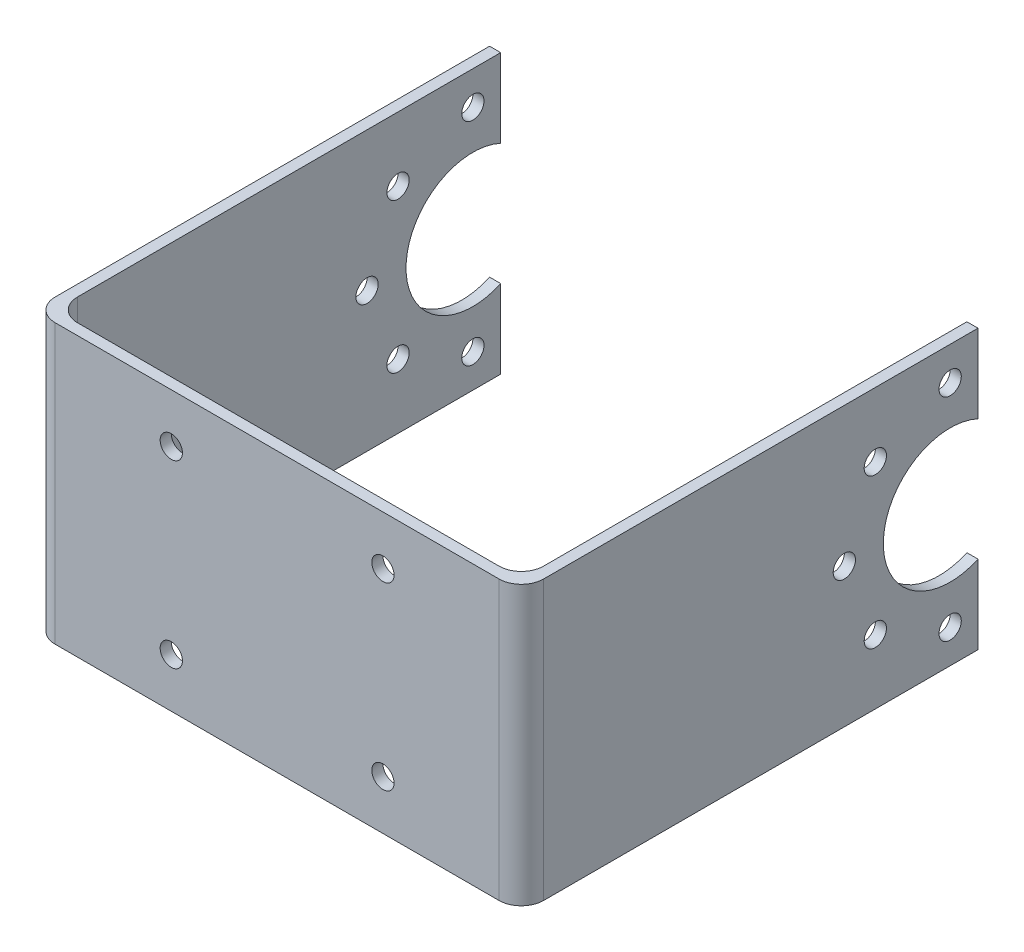
ISO-10303-21;
HEADER;
FILE_DESCRIPTION(('STEP AP214'),'2;1');
FILE_NAME('part.step','',(''),(''),'','','');
FILE_SCHEMA(('AUTOMOTIVE_DESIGN { 1 0 10303 214 1 1 1 1 }'));
ENDSEC;
DATA;
#1=APPLICATION_CONTEXT('core data for automotive mechanical design processes');
#2=APPLICATION_PROTOCOL_DEFINITION('international standard','automotive_design',2000,#1);
#3=PRODUCT_CONTEXT('',#1,'mechanical');
#4=PRODUCT('Part','Part','',(#3));
#5=PRODUCT_RELATED_PRODUCT_CATEGORY('part','',(#4));
#6=PRODUCT_DEFINITION_FORMATION('','',#4);
#7=PRODUCT_DEFINITION_CONTEXT('part definition',#1,'design');
#8=PRODUCT_DEFINITION('design','',#6,#7);
#9=PRODUCT_DEFINITION_SHAPE('','',#8);
#10=(LENGTH_UNIT() NAMED_UNIT(*) SI_UNIT(.MILLI.,.METRE.));
#11=(NAMED_UNIT(*) PLANE_ANGLE_UNIT() SI_UNIT($,.RADIAN.));
#12=(NAMED_UNIT(*) SI_UNIT($,.STERADIAN.) SOLID_ANGLE_UNIT());
#13=UNCERTAINTY_MEASURE_WITH_UNIT(LENGTH_MEASURE(1.E-05),#10,'distance_accuracy_value','');
#14=(GEOMETRIC_REPRESENTATION_CONTEXT(3) GLOBAL_UNCERTAINTY_ASSIGNED_CONTEXT((#13)) GLOBAL_UNIT_ASSIGNED_CONTEXT((#10,
#11,#12)) REPRESENTATION_CONTEXT('',''));
#15=CARTESIAN_POINT('',(0.,0.,0.));
#16=DIRECTION('',(0.,0.,1.));
#17=DIRECTION('',(1.,0.,0.));
#18=AXIS2_PLACEMENT_3D('',#15,#16,#17);
#19=CARTESIAN_POINT('',(21.3500000000001,25.,-40.5));
#20=DIRECTION('',(0.,0.,1.));
#21=DIRECTION('',(1.,0.,0.));
#22=AXIS2_PLACEMENT_3D('',#19,#20,#21);
#23=PLANE('',#22);
#24=DIRECTION('',(0.,-1.,0.));
#25=VECTOR('',#24,1.);
#26=CARTESIAN_POINT('',(20.3500000000001,25.,-40.5));
#27=LINE('',#26,#25);
#28=CARTESIAN_POINT('',(20.3500000000001,7.04564394268216,-40.5));
#29=VERTEX_POINT('',#28);
#30=CARTESIAN_POINT('',(20.3500000000001,0.,-40.5));
#31=VERTEX_POINT('',#30);
#32=EDGE_CURVE('E216',#29,#31,#27,.T.);
#33=ORIENTED_EDGE('',*,*,#32,.F.);
#34=DIRECTION('',(1.,0.,0.));
#35=VECTOR('',#34,1.);
#36=CARTESIAN_POINT('',(-22.4999999999999,7.04564394268215,-40.5));
#37=LINE('',#36,#35);
#38=CARTESIAN_POINT('',(21.3500000000001,7.04564394268215,-40.5));
#39=VERTEX_POINT('',#38);
#40=EDGE_CURVE('E200',#29,#39,#37,.T.);
#41=ORIENTED_EDGE('',*,*,#40,.T.);
#42=DIRECTION('',(0.,-1.,0.));
#43=VECTOR('',#42,1.);
#44=CARTESIAN_POINT('',(21.3500000000001,25.,-40.5));
#45=LINE('',#44,#43);
#46=CARTESIAN_POINT('',(21.3500000000001,0.,-40.5));
#47=VERTEX_POINT('',#46);
#48=EDGE_CURVE('E220',#39,#47,#45,.T.);
#49=ORIENTED_EDGE('',*,*,#48,.T.);
#50=DIRECTION('',(-1.,0.,0.));
#51=VECTOR('',#50,1.);
#52=CARTESIAN_POINT('',(21.3500000000001,0.,-40.5));
#53=LINE('',#52,#51);
#54=EDGE_CURVE('E272',#47,#31,#53,.T.);
#55=ORIENTED_EDGE('',*,*,#54,.T.);
#56=EDGE_LOOP('',(#33,#41,#49,#55));
#57=FACE_BOUND('',#56,.T.);
#58=ADVANCED_FACE('F65',(#57),#23,.F.);
#59=CARTESIAN_POINT('',(-22.4999999999999,25.,-40.5));
#60=DIRECTION('',(0.,0.,1.));
#61=DIRECTION('',(1.,0.,0.));
#62=AXIS2_PLACEMENT_3D('',#59,#60,#61);
#63=PLANE('',#62);
#64=DIRECTION('',(0.,-1.,0.));
#65=VECTOR('',#64,1.);
#66=CARTESIAN_POINT('',(-22.4999999999999,25.,-40.5));
#67=LINE('',#66,#65);
#68=CARTESIAN_POINT('',(-22.4999999999999,7.04564394268215,-40.5));
#69=VERTEX_POINT('',#68);
#70=CARTESIAN_POINT('',(-22.4999999999999,0.,-40.5));
#71=VERTEX_POINT('',#70);
#72=EDGE_CURVE('E207',#69,#71,#67,.T.);
#73=ORIENTED_EDGE('',*,*,#72,.F.);
#74=CARTESIAN_POINT('',(-21.4999999999999,7.04564394268215,-40.5));
#75=VERTEX_POINT('',#74);
#76=EDGE_CURVE('E184',#69,#75,#37,.T.);
#77=ORIENTED_EDGE('',*,*,#76,.T.);
#78=DIRECTION('',(0.,-1.,0.));
#79=VECTOR('',#78,1.);
#80=CARTESIAN_POINT('',(-21.4999999999999,25.,-40.5));
#81=LINE('',#80,#79);
#82=CARTESIAN_POINT('',(-21.4999999999999,0.,-40.5));
#83=VERTEX_POINT('',#82);
#84=EDGE_CURVE('E206',#75,#83,#81,.T.);
#85=ORIENTED_EDGE('',*,*,#84,.T.);
#86=DIRECTION('',(-1.,0.,0.));
#87=VECTOR('',#86,1.);
#88=CARTESIAN_POINT('',(-22.4999999999999,0.,-40.5));
#89=LINE('',#88,#87);
#90=EDGE_CURVE('E298',#83,#71,#89,.T.);
#91=ORIENTED_EDGE('',*,*,#90,.T.);
#92=EDGE_LOOP('',(#73,#77,#85,#91));
#93=FACE_BOUND('',#92,.T.);
#94=ADVANCED_FACE('F450',(#93),#63,.F.);
#95=CARTESIAN_POINT('',(21.3500000000001,25.,-0.500000000000001));
#96=DIRECTION('',(-1.,0.,0.));
#97=DIRECTION('',(0.,0.,1.));
#98=AXIS2_PLACEMENT_3D('',#95,#96,#97);
#99=PLANE('',#98);
#100=CARTESIAN_POINT('',(21.3500000000001,5.7824855787278,-31.2824855787278));
#101=DIRECTION('',(1.,0.,0.));
#102=DIRECTION('',(0.,0.,-1.));
#103=AXIS2_PLACEMENT_3D('',#100,#101,#102);
#104=CIRCLE('',#103,0.999999999999998);
#105=CARTESIAN_POINT('',(21.3500000000001,5.7824855787278,-32.2824855787278));
#106=VERTEX_POINT('',#105);
#107=EDGE_CURVE('E370',#106,#106,#104,.T.);
#108=ORIENTED_EDGE('',*,*,#107,.F.);
#109=EDGE_LOOP('',(#108));
#110=FACE_BOUND('',#109,.T.);
#111=CARTESIAN_POINT('',(21.3500000000001,3.,-38.));
#112=DIRECTION('',(1.,0.,0.));
#113=DIRECTION('',(0.,0.,-1.));
#114=AXIS2_PLACEMENT_3D('',#111,#112,#113);
#115=CIRCLE('',#114,0.999999999999998);
#116=CARTESIAN_POINT('',(21.3500000000001,3.,-39.));
#117=VERTEX_POINT('',#116);
#118=EDGE_CURVE('E358',#117,#117,#115,.T.);
#119=ORIENTED_EDGE('',*,*,#118,.F.);
#120=EDGE_LOOP('',(#119));
#121=FACE_BOUND('',#120,.T.);
#122=CARTESIAN_POINT('',(21.3500000000001,12.5,-28.5));
#123=DIRECTION('',(1.,0.,0.));
#124=DIRECTION('',(0.,0.,-1.));
#125=AXIS2_PLACEMENT_3D('',#122,#123,#124);
#126=CIRCLE('',#125,1.);
#127=CARTESIAN_POINT('',(21.3500000000001,12.5,-29.5));
#128=VERTEX_POINT('',#127);
#129=EDGE_CURVE('E346',#128,#128,#126,.T.);
#130=ORIENTED_EDGE('',*,*,#129,.F.);
#131=EDGE_LOOP('',(#130));
#132=FACE_BOUND('',#131,.T.);
#133=CARTESIAN_POINT('',(21.3500000000001,19.2175144212722,-31.2824855787278));
#134=DIRECTION('',(1.,0.,0.));
#135=DIRECTION('',(0.,0.,-1.));
#136=AXIS2_PLACEMENT_3D('',#133,#134,#135);
#137=CIRCLE('',#136,1.00000000000001);
#138=CARTESIAN_POINT('',(21.3500000000001,19.2175144212722,-32.2824855787278));
#139=VERTEX_POINT('',#138);
#140=EDGE_CURVE('E334',#139,#139,#137,.T.);
#141=ORIENTED_EDGE('',*,*,#140,.F.);
#142=EDGE_LOOP('',(#141));
#143=FACE_BOUND('',#142,.T.);
#144=CARTESIAN_POINT('',(21.3500000000001,22.,-38.));
#145=DIRECTION('',(1.,0.,0.));
#146=DIRECTION('',(0.,0.,-1.));
#147=AXIS2_PLACEMENT_3D('',#144,#145,#146);
#148=CIRCLE('',#147,0.999999999999998);
#149=CARTESIAN_POINT('',(21.3500000000001,22.,-39.));
#150=VERTEX_POINT('',#149);
#151=EDGE_CURVE('E322',#150,#150,#148,.T.);
#152=ORIENTED_EDGE('',*,*,#151,.F.);
#153=EDGE_LOOP('',(#152));
#154=FACE_BOUND('',#153,.T.);
#155=DIRECTION('',(0.,0.,-1.));
#156=VECTOR('',#155,1.);
#157=CARTESIAN_POINT('',(21.3500000000001,25.,-0.500000000000001));
#158=LINE('',#157,#156);
#159=CARTESIAN_POINT('',(21.3500000000001,25.,-1.5));
#160=VERTEX_POINT('',#159);
#161=CARTESIAN_POINT('',(21.3500000000001,25.,-40.5));
#162=VERTEX_POINT('',#161);
#163=EDGE_CURVE('E304',#160,#162,#158,.T.);
#164=ORIENTED_EDGE('',*,*,#163,.F.);
#165=DIRECTION('',(0.,-1.,0.));
#166=VECTOR('',#165,1.);
#167=CARTESIAN_POINT('',(21.3500000000001,25.,-1.5));
#168=LINE('',#167,#166);
#169=CARTESIAN_POINT('',(21.3500000000001,0.,-1.5));
#170=VERTEX_POINT('',#169);
#171=EDGE_CURVE('E246',#160,#170,#168,.T.);
#172=ORIENTED_EDGE('',*,*,#171,.T.);
#173=DIRECTION('',(0.,0.,-1.));
#174=VECTOR('',#173,1.);
#175=CARTESIAN_POINT('',(21.3500000000001,0.,-0.500000000000001));
#176=LINE('',#175,#174);
#177=EDGE_CURVE('E291',#170,#47,#176,.T.);
#178=ORIENTED_EDGE('',*,*,#177,.T.);
#179=ORIENTED_EDGE('',*,*,#48,.F.);
#180=CARTESIAN_POINT('',(21.3500000000001,12.5,-38.));
#181=DIRECTION('',(1.,0.,0.));
#182=DIRECTION('',(0.,0.,-1.));
#183=AXIS2_PLACEMENT_3D('',#180,#181,#182);
#184=CIRCLE('',#183,5.99999999999999);
#185=CARTESIAN_POINT('',(21.3500000000001,17.9543560573178,-40.5));
#186=VERTEX_POINT('',#185);
#187=EDGE_CURVE('E189',#186,#39,#184,.T.);
#188=ORIENTED_EDGE('',*,*,#187,.F.);
#189=EDGE_CURVE('E221',#162,#186,#45,.T.);
#190=ORIENTED_EDGE('',*,*,#189,.F.);
#191=EDGE_LOOP('',(#164,#172,#178,#179,#188,#190));
#192=FACE_BOUND('',#191,.T.);
#193=ADVANCED_FACE('F425',(#110,#121,#132,#143,#154,#192),#99,.F.);
#194=ORIENTED_EDGE('',*,*,#189,.T.);
#195=DIRECTION('',(1.,0.,0.));
#196=VECTOR('',#195,1.);
#197=CARTESIAN_POINT('',(-22.4999999999999,17.9543560573178,-40.5));
#198=LINE('',#197,#196);
#199=CARTESIAN_POINT('',(20.3500000000001,17.9543560573178,-40.5));
#200=VERTEX_POINT('',#199);
#201=EDGE_CURVE('E188',#200,#186,#198,.T.);
#202=ORIENTED_EDGE('',*,*,#201,.F.);
#203=CARTESIAN_POINT('',(20.3500000000001,25.,-40.5));
#204=VERTEX_POINT('',#203);
#205=EDGE_CURVE('E217',#204,#200,#27,.T.);
#206=ORIENTED_EDGE('',*,*,#205,.F.);
#207=DIRECTION('',(-1.,0.,0.));
#208=VECTOR('',#207,1.);
#209=CARTESIAN_POINT('',(21.3500000000001,25.,-40.5));
#210=LINE('',#209,#208);
#211=EDGE_CURVE('E283',#162,#204,#210,.T.);
#212=ORIENTED_EDGE('',*,*,#211,.F.);
#213=EDGE_LOOP('',(#194,#202,#206,#212));
#214=FACE_BOUND('',#213,.T.);
#215=ADVANCED_FACE('F433',(#214),#23,.F.);
#216=CARTESIAN_POINT('',(20.3500000000001,25.,-0.499999999999996));
#217=DIRECTION('',(1.,0.,0.));
#218=DIRECTION('',(0.,0.,-1.));
#219=AXIS2_PLACEMENT_3D('',#216,#217,#218);
#220=PLANE('',#219);
#221=CARTESIAN_POINT('',(20.3500000000001,5.7824855787278,-31.2824855787278));
#222=DIRECTION('',(1.,0.,0.));
#223=DIRECTION('',(0.,0.,-1.));
#224=AXIS2_PLACEMENT_3D('',#221,#222,#223);
#225=CIRCLE('',#224,0.999999999999998);
#226=CARTESIAN_POINT('',(20.3500000000001,5.7824855787278,-32.2824855787278));
#227=VERTEX_POINT('',#226);
#228=EDGE_CURVE('E362',#227,#227,#225,.T.);
#229=ORIENTED_EDGE('',*,*,#228,.T.);
#230=EDGE_LOOP('',(#229));
#231=FACE_BOUND('',#230,.T.);
#232=CARTESIAN_POINT('',(20.3500000000001,3.,-38.));
#233=DIRECTION('',(1.,0.,0.));
#234=DIRECTION('',(0.,0.,-1.));
#235=AXIS2_PLACEMENT_3D('',#232,#233,#234);
#236=CIRCLE('',#235,0.999999999999998);
#237=CARTESIAN_POINT('',(20.3500000000001,3.,-39.));
#238=VERTEX_POINT('',#237);
#239=EDGE_CURVE('E350',#238,#238,#236,.T.);
#240=ORIENTED_EDGE('',*,*,#239,.T.);
#241=EDGE_LOOP('',(#240));
#242=FACE_BOUND('',#241,.T.);
#243=CARTESIAN_POINT('',(20.3500000000001,12.5,-28.5));
#244=DIRECTION('',(1.,0.,0.));
#245=DIRECTION('',(0.,0.,-1.));
#246=AXIS2_PLACEMENT_3D('',#243,#244,#245);
#247=CIRCLE('',#246,1.);
#248=CARTESIAN_POINT('',(20.3500000000001,12.5,-29.5));
#249=VERTEX_POINT('',#248);
#250=EDGE_CURVE('E338',#249,#249,#247,.T.);
#251=ORIENTED_EDGE('',*,*,#250,.T.);
#252=EDGE_LOOP('',(#251));
#253=FACE_BOUND('',#252,.T.);
#254=CARTESIAN_POINT('',(20.3500000000001,19.2175144212722,-31.2824855787278));
#255=DIRECTION('',(1.,0.,0.));
#256=DIRECTION('',(0.,0.,-1.));
#257=AXIS2_PLACEMENT_3D('',#254,#255,#256);
#258=CIRCLE('',#257,1.00000000000001);
#259=CARTESIAN_POINT('',(20.3500000000001,19.2175144212722,-32.2824855787278));
#260=VERTEX_POINT('',#259);
#261=EDGE_CURVE('E326',#260,#260,#258,.T.);
#262=ORIENTED_EDGE('',*,*,#261,.T.);
#263=EDGE_LOOP('',(#262));
#264=FACE_BOUND('',#263,.T.);
#265=CARTESIAN_POINT('',(20.3500000000001,22.,-38.));
#266=DIRECTION('',(1.,0.,0.));
#267=DIRECTION('',(0.,0.,-1.));
#268=AXIS2_PLACEMENT_3D('',#265,#266,#267);
#269=CIRCLE('',#268,0.999999999999998);
#270=CARTESIAN_POINT('',(20.3500000000001,22.,-39.));
#271=VERTEX_POINT('',#270);
#272=EDGE_CURVE('E315',#271,#271,#269,.T.);
#273=ORIENTED_EDGE('',*,*,#272,.T.);
#274=EDGE_LOOP('',(#273));
#275=FACE_BOUND('',#274,.T.);
#276=DIRECTION('',(0.,0.,1.));
#277=VECTOR('',#276,1.);
#278=CARTESIAN_POINT('',(20.3500000000001,0.,-0.499999999999996));
#279=LINE('',#278,#277);
#280=CARTESIAN_POINT('',(20.3500000000001,0.,-2.5));
#281=VERTEX_POINT('',#280);
#282=EDGE_CURVE('E260',#31,#281,#279,.T.);
#283=ORIENTED_EDGE('',*,*,#282,.T.);
#284=DIRECTION('',(0.,-1.,0.));
#285=VECTOR('',#284,1.);
#286=CARTESIAN_POINT('',(20.3500000000001,25.,-2.5));
#287=LINE('',#286,#285);
#288=CARTESIAN_POINT('',(20.3500000000001,25.,-2.5));
#289=VERTEX_POINT('',#288);
#290=EDGE_CURVE('E249',#281,#289,#287,.F.);
#291=ORIENTED_EDGE('',*,*,#290,.T.);
#292=DIRECTION('',(0.,0.,1.));
#293=VECTOR('',#292,1.);
#294=CARTESIAN_POINT('',(20.3500000000001,25.,-0.499999999999996));
#295=LINE('',#294,#293);
#296=EDGE_CURVE('E277',#204,#289,#295,.T.);
#297=ORIENTED_EDGE('',*,*,#296,.F.);
#298=ORIENTED_EDGE('',*,*,#205,.T.);
#299=CARTESIAN_POINT('',(20.3500000000001,12.5,-38.));
#300=DIRECTION('',(1.,0.,0.));
#301=DIRECTION('',(0.,0.,-1.));
#302=AXIS2_PLACEMENT_3D('',#299,#300,#301);
#303=CIRCLE('',#302,5.99999999999999);
#304=EDGE_CURVE('E293',#200,#29,#303,.T.);
#305=ORIENTED_EDGE('',*,*,#304,.T.);
#306=ORIENTED_EDGE('',*,*,#32,.T.);
#307=EDGE_LOOP('',(#283,#291,#297,#298,#305,#306));
#308=FACE_BOUND('',#307,.T.);
#309=ADVANCED_FACE('F266',(#231,#242,#253,#264,#275,#308),#220,.F.);
#310=CARTESIAN_POINT('',(-21.4999999999999,25.,-0.499999999999996));
#311=DIRECTION('',(0.,0.,1.));
#312=DIRECTION('',(1.,0.,0.));
#313=AXIS2_PLACEMENT_3D('',#310,#311,#312);
#314=PLANE('',#313);
#315=CARTESIAN_POINT('',(8.92500000000006,4.415,-0.499999999999994));
#316=DIRECTION('',(0.,0.,1.));
#317=DIRECTION('',(1.,0.,0.));
#318=AXIS2_PLACEMENT_3D('',#315,#316,#317);
#319=CIRCLE('',#318,1.);
#320=CARTESIAN_POINT('',(9.92500000000006,4.415,-0.499999999999994));
#321=VERTEX_POINT('',#320);
#322=EDGE_CURVE('E394',#321,#321,#319,.T.);
#323=ORIENTED_EDGE('',*,*,#322,.T.);
#324=EDGE_LOOP('',(#323));
#325=FACE_BOUND('',#324,.T.);
#326=CARTESIAN_POINT('',(8.92500000000006,20.585,-0.499999999999994));
#327=DIRECTION('',(0.,0.,1.));
#328=DIRECTION('',(1.,0.,0.));
#329=AXIS2_PLACEMENT_3D('',#326,#327,#328);
#330=CIRCLE('',#329,1.);
#331=CARTESIAN_POINT('',(9.92500000000006,20.585,-0.499999999999994));
#332=VERTEX_POINT('',#331);
#333=EDGE_CURVE('E388',#332,#332,#330,.T.);
#334=ORIENTED_EDGE('',*,*,#333,.T.);
#335=EDGE_LOOP('',(#334));
#336=FACE_BOUND('',#335,.T.);
#337=CARTESIAN_POINT('',(-10.0749999999999,4.415,-0.499999999999994));
#338=DIRECTION('',(0.,0.,1.));
#339=DIRECTION('',(1.,0.,0.));
#340=AXIS2_PLACEMENT_3D('',#337,#338,#339);
#341=CIRCLE('',#340,1.);
#342=CARTESIAN_POINT('',(-9.07499999999994,4.415,-0.499999999999994));
#343=VERTEX_POINT('',#342);
#344=EDGE_CURVE('E382',#343,#343,#341,.T.);
#345=ORIENTED_EDGE('',*,*,#344,.T.);
#346=EDGE_LOOP('',(#345));
#347=FACE_BOUND('',#346,.T.);
#348=CARTESIAN_POINT('',(-10.0749999999999,20.585,-0.499999999999994));
#349=DIRECTION('',(0.,0.,1.));
#350=DIRECTION('',(1.,0.,0.));
#351=AXIS2_PLACEMENT_3D('',#348,#349,#350);
#352=CIRCLE('',#351,1.);
#353=CARTESIAN_POINT('',(-9.07499999999994,20.585,-0.499999999999994));
#354=VERTEX_POINT('',#353);
#355=EDGE_CURVE('E374',#354,#354,#352,.T.);
#356=ORIENTED_EDGE('',*,*,#355,.T.);
#357=EDGE_LOOP('',(#356));
#358=FACE_BOUND('',#357,.T.);
#359=DIRECTION('',(-1.,0.,0.));
#360=VECTOR('',#359,1.);
#361=CARTESIAN_POINT('',(-21.4999999999999,0.,-0.499999999999996));
#362=LINE('',#361,#360);
#363=CARTESIAN_POINT('',(18.35,0.,-0.499999999999996));
#364=VERTEX_POINT('',#363);
#365=CARTESIAN_POINT('',(-19.4999999999999,0.,-0.499999999999996));
#366=VERTEX_POINT('',#365);
#367=EDGE_CURVE('E261',#364,#366,#362,.T.);
#368=ORIENTED_EDGE('',*,*,#367,.T.);
#369=DIRECTION('',(0.,-1.,0.));
#370=VECTOR('',#369,1.);
#371=CARTESIAN_POINT('',(-19.4999999999999,25.,-0.499999999999996));
#372=LINE('',#371,#370);
#373=CARTESIAN_POINT('',(-19.4999999999999,25.,-0.499999999999996));
#374=VERTEX_POINT('',#373);
#375=EDGE_CURVE('E88',#366,#374,#372,.F.);
#376=ORIENTED_EDGE('',*,*,#375,.T.);
#377=DIRECTION('',(-1.,0.,0.));
#378=VECTOR('',#377,1.);
#379=CARTESIAN_POINT('',(-21.4999999999999,25.,-0.499999999999996));
#380=LINE('',#379,#378);
#381=CARTESIAN_POINT('',(18.35,25.,-0.499999999999996));
#382=VERTEX_POINT('',#381);
#383=EDGE_CURVE('E276',#382,#374,#380,.T.);
#384=ORIENTED_EDGE('',*,*,#383,.F.);
#385=DIRECTION('',(0.,-1.,0.));
#386=VECTOR('',#385,1.);
#387=CARTESIAN_POINT('',(18.3500000000001,0.,-0.499999999999996));
#388=LINE('',#387,#386);
#389=EDGE_CURVE('E242',#382,#364,#388,.T.);
#390=ORIENTED_EDGE('',*,*,#389,.T.);
#391=EDGE_LOOP('',(#368,#376,#384,#390));
#392=FACE_BOUND('',#391,.T.);
#393=ADVANCED_FACE('F278',(#325,#336,#347,#358,#392),#314,.F.);
#394=CARTESIAN_POINT('',(-21.4999999999999,25.,-0.499999999999996));
#395=DIRECTION('',(-1.,0.,0.));
#396=DIRECTION('',(0.,0.,1.));
#397=AXIS2_PLACEMENT_3D('',#394,#395,#396);
#398=PLANE('',#397);
#399=CARTESIAN_POINT('',(-21.4999999999999,5.7824855787278,-31.2824855787278));
#400=DIRECTION('',(-1.,0.,0.));
#401=DIRECTION('',(0.,0.,1.));
#402=AXIS2_PLACEMENT_3D('',#399,#400,#401);
#403=CIRCLE('',#402,0.999999999999998);
#404=CARTESIAN_POINT('',(-21.4999999999999,5.7824855787278,-30.2824855787278));
#405=VERTEX_POINT('',#404);
#406=EDGE_CURVE('E367',#405,#405,#403,.T.);
#407=ORIENTED_EDGE('',*,*,#406,.T.);
#408=EDGE_LOOP('',(#407));
#409=FACE_BOUND('',#408,.T.);
#410=CARTESIAN_POINT('',(-21.4999999999999,3.,-38.));
#411=DIRECTION('',(-1.,0.,0.));
#412=DIRECTION('',(0.,0.,1.));
#413=AXIS2_PLACEMENT_3D('',#410,#411,#412);
#414=CIRCLE('',#413,0.999999999999998);
#415=CARTESIAN_POINT('',(-21.4999999999999,3.,-37.));
#416=VERTEX_POINT('',#415);
#417=EDGE_CURVE('E355',#416,#416,#414,.T.);
#418=ORIENTED_EDGE('',*,*,#417,.T.);
#419=EDGE_LOOP('',(#418));
#420=FACE_BOUND('',#419,.T.);
#421=CARTESIAN_POINT('',(-21.4999999999999,12.5,-28.5));
#422=DIRECTION('',(-1.,0.,0.));
#423=DIRECTION('',(0.,0.,1.));
#424=AXIS2_PLACEMENT_3D('',#421,#422,#423);
#425=CIRCLE('',#424,1.);
#426=CARTESIAN_POINT('',(-21.4999999999999,12.5,-27.5));
#427=VERTEX_POINT('',#426);
#428=EDGE_CURVE('E343',#427,#427,#425,.T.);
#429=ORIENTED_EDGE('',*,*,#428,.T.);
#430=EDGE_LOOP('',(#429));
#431=FACE_BOUND('',#430,.T.);
#432=CARTESIAN_POINT('',(-21.4999999999999,19.2175144212722,-31.2824855787278));
#433=DIRECTION('',(-1.,0.,0.));
#434=DIRECTION('',(0.,0.,1.));
#435=AXIS2_PLACEMENT_3D('',#432,#433,#434);
#436=CIRCLE('',#435,1.00000000000001);
#437=CARTESIAN_POINT('',(-21.4999999999999,19.2175144212722,-30.2824855787278));
#438=VERTEX_POINT('',#437);
#439=EDGE_CURVE('E331',#438,#438,#436,.T.);
#440=ORIENTED_EDGE('',*,*,#439,.T.);
#441=EDGE_LOOP('',(#440));
#442=FACE_BOUND('',#441,.T.);
#443=CARTESIAN_POINT('',(-21.4999999999999,22.,-38.));
#444=DIRECTION('',(-1.,0.,0.));
#445=DIRECTION('',(0.,0.,1.));
#446=AXIS2_PLACEMENT_3D('',#443,#444,#445);
#447=CIRCLE('',#446,0.999999999999998);
#448=CARTESIAN_POINT('',(-21.4999999999999,22.,-37.));
#449=VERTEX_POINT('',#448);
#450=EDGE_CURVE('E319',#449,#449,#447,.T.);
#451=ORIENTED_EDGE('',*,*,#450,.T.);
#452=EDGE_LOOP('',(#451));
#453=FACE_BOUND('',#452,.T.);
#454=DIRECTION('',(0.,0.,-1.));
#455=VECTOR('',#454,1.);
#456=CARTESIAN_POINT('',(-21.4999999999999,25.,-0.499999999999996));
#457=LINE('',#456,#455);
#458=CARTESIAN_POINT('',(-21.4999999999999,25.,-2.5));
#459=VERTEX_POINT('',#458);
#460=CARTESIAN_POINT('',(-21.4999999999999,25.,-40.5));
#461=VERTEX_POINT('',#460);
#462=EDGE_CURVE('E279',#459,#461,#457,.T.);
#463=ORIENTED_EDGE('',*,*,#462,.F.);
#464=DIRECTION('',(0.,-1.,0.));
#465=VECTOR('',#464,1.);
#466=CARTESIAN_POINT('',(-21.4999999999999,0.,-2.5));
#467=LINE('',#466,#465);
#468=CARTESIAN_POINT('',(-21.4999999999999,0.,-2.5));
#469=VERTEX_POINT('',#468);
#470=EDGE_CURVE('E239',#459,#469,#467,.T.);
#471=ORIENTED_EDGE('',*,*,#470,.T.);
#472=DIRECTION('',(0.,0.,-1.));
#473=VECTOR('',#472,1.);
#474=CARTESIAN_POINT('',(-21.4999999999999,0.,-0.499999999999996));
#475=LINE('',#474,#473);
#476=EDGE_CURVE('E296',#469,#83,#475,.T.);
#477=ORIENTED_EDGE('',*,*,#476,.T.);
#478=ORIENTED_EDGE('',*,*,#84,.F.);
#479=CARTESIAN_POINT('',(-21.4999999999999,12.5,-38.));
#480=DIRECTION('',(-1.,0.,0.));
#481=DIRECTION('',(0.,0.,1.));
#482=AXIS2_PLACEMENT_3D('',#479,#480,#481);
#483=CIRCLE('',#482,5.99999999999999);
#484=CARTESIAN_POINT('',(-21.4999999999999,17.9543560573178,-40.5));
#485=VERTEX_POINT('',#484);
#486=EDGE_CURVE('E312',#75,#485,#483,.T.);
#487=ORIENTED_EDGE('',*,*,#486,.T.);
#488=EDGE_CURVE('E199',#461,#485,#81,.T.);
#489=ORIENTED_EDGE('',*,*,#488,.F.);
#490=EDGE_LOOP('',(#463,#471,#477,#478,#487,#489));
#491=FACE_BOUND('',#490,.T.);
#492=ADVANCED_FACE('F532',(#409,#420,#431,#442,#453,#491),#398,.F.);
#493=ORIENTED_EDGE('',*,*,#488,.T.);
#494=CARTESIAN_POINT('',(-22.4999999999999,17.9543560573178,-40.5));
#495=VERTEX_POINT('',#494);
#496=EDGE_CURVE('E181',#495,#485,#198,.T.);
#497=ORIENTED_EDGE('',*,*,#496,.F.);
#498=CARTESIAN_POINT('',(-22.4999999999999,25.,-40.5));
#499=VERTEX_POINT('',#498);
#500=EDGE_CURVE('E196',#499,#495,#67,.T.);
#501=ORIENTED_EDGE('',*,*,#500,.F.);
#502=DIRECTION('',(-1.,0.,0.));
#503=VECTOR('',#502,1.);
#504=CARTESIAN_POINT('',(-22.4999999999999,25.,-40.5));
#505=LINE('',#504,#503);
#506=EDGE_CURVE('E281',#461,#499,#505,.T.);
#507=ORIENTED_EDGE('',*,*,#506,.F.);
#508=EDGE_LOOP('',(#493,#497,#501,#507));
#509=FACE_BOUND('',#508,.T.);
#510=ADVANCED_FACE('F194',(#509),#63,.F.);
#511=CARTESIAN_POINT('',(-22.4999999999999,25.,-0.499999999999996));
#512=DIRECTION('',(1.,0.,0.));
#513=DIRECTION('',(0.,0.,-1.));
#514=AXIS2_PLACEMENT_3D('',#511,#512,#513);
#515=PLANE('',#514);
#516=CARTESIAN_POINT('',(-22.4999999999999,5.7824855787278,-31.2824855787278));
#517=DIRECTION('',(1.,0.,0.));
#518=DIRECTION('',(0.,0.,-1.));
#519=AXIS2_PLACEMENT_3D('',#516,#517,#518);
#520=CIRCLE('',#519,0.999999999999998);
#521=CARTESIAN_POINT('',(-22.4999999999999,5.7824855787278,-32.2824855787278));
#522=VERTEX_POINT('',#521);
#523=EDGE_CURVE('E371',#522,#522,#520,.T.);
#524=ORIENTED_EDGE('',*,*,#523,.T.);
#525=EDGE_LOOP('',(#524));
#526=FACE_BOUND('',#525,.T.);
#527=CARTESIAN_POINT('',(-22.4999999999999,3.,-38.));
#528=DIRECTION('',(1.,0.,0.));
#529=DIRECTION('',(0.,0.,-1.));
#530=AXIS2_PLACEMENT_3D('',#527,#528,#529);
#531=CIRCLE('',#530,0.999999999999998);
#532=CARTESIAN_POINT('',(-22.4999999999999,3.,-39.));
#533=VERTEX_POINT('',#532);
#534=EDGE_CURVE('E359',#533,#533,#531,.T.);
#535=ORIENTED_EDGE('',*,*,#534,.T.);
#536=EDGE_LOOP('',(#535));
#537=FACE_BOUND('',#536,.T.);
#538=CARTESIAN_POINT('',(-22.4999999999999,12.5,-28.5));
#539=DIRECTION('',(1.,0.,0.));
#540=DIRECTION('',(0.,0.,-1.));
#541=AXIS2_PLACEMENT_3D('',#538,#539,#540);
#542=CIRCLE('',#541,1.);
#543=CARTESIAN_POINT('',(-22.4999999999999,12.5,-29.5));
#544=VERTEX_POINT('',#543);
#545=EDGE_CURVE('E347',#544,#544,#542,.T.);
#546=ORIENTED_EDGE('',*,*,#545,.T.);
#547=EDGE_LOOP('',(#546));
#548=FACE_BOUND('',#547,.T.);
#549=CARTESIAN_POINT('',(-22.4999999999999,19.2175144212722,-31.2824855787278));
#550=DIRECTION('',(1.,0.,0.));
#551=DIRECTION('',(0.,0.,-1.));
#552=AXIS2_PLACEMENT_3D('',#549,#550,#551);
#553=CIRCLE('',#552,1.00000000000001);
#554=CARTESIAN_POINT('',(-22.4999999999999,19.2175144212722,-32.2824855787278));
#555=VERTEX_POINT('',#554);
#556=EDGE_CURVE('E335',#555,#555,#553,.T.);
#557=ORIENTED_EDGE('',*,*,#556,.T.);
#558=EDGE_LOOP('',(#557));
#559=FACE_BOUND('',#558,.T.);
#560=CARTESIAN_POINT('',(-22.4999999999999,22.,-38.));
#561=DIRECTION('',(1.,0.,0.));
#562=DIRECTION('',(0.,0.,-1.));
#563=AXIS2_PLACEMENT_3D('',#560,#561,#562);
#564=CIRCLE('',#563,0.999999999999998);
#565=CARTESIAN_POINT('',(-22.4999999999999,22.,-39.));
#566=VERTEX_POINT('',#565);
#567=EDGE_CURVE('E323',#566,#566,#564,.T.);
#568=ORIENTED_EDGE('',*,*,#567,.T.);
#569=EDGE_LOOP('',(#568));
#570=FACE_BOUND('',#569,.T.);
#571=DIRECTION('',(0.,0.,1.));
#572=VECTOR('',#571,1.);
#573=CARTESIAN_POINT('',(-22.4999999999999,0.,-0.499999999999996));
#574=LINE('',#573,#572);
#575=CARTESIAN_POINT('',(-22.4999999999999,0.,-1.5));
#576=VERTEX_POINT('',#575);
#577=EDGE_CURVE('E300',#71,#576,#574,.T.);
#578=ORIENTED_EDGE('',*,*,#577,.T.);
#579=DIRECTION('',(0.,-1.,0.));
#580=VECTOR('',#579,1.);
#581=CARTESIAN_POINT('',(-22.4999999999999,25.,-1.5));
#582=LINE('',#581,#580);
#583=CARTESIAN_POINT('',(-22.4999999999999,25.,-1.5));
#584=VERTEX_POINT('',#583);
#585=EDGE_CURVE('E233',#576,#584,#582,.F.);
#586=ORIENTED_EDGE('',*,*,#585,.T.);
#587=DIRECTION('',(0.,0.,1.));
#588=VECTOR('',#587,1.);
#589=CARTESIAN_POINT('',(-22.4999999999999,25.,-0.499999999999996));
#590=LINE('',#589,#588);
#591=EDGE_CURVE('E205',#499,#584,#590,.T.);
#592=ORIENTED_EDGE('',*,*,#591,.F.);
#593=ORIENTED_EDGE('',*,*,#500,.T.);
#594=CARTESIAN_POINT('',(-22.4999999999999,12.5,-38.));
#595=DIRECTION('',(1.,0.,0.));
#596=DIRECTION('',(0.,0.,-1.));
#597=AXIS2_PLACEMENT_3D('',#594,#595,#596);
#598=CIRCLE('',#597,5.99999999999999);
#599=EDGE_CURVE('E178',#495,#69,#598,.T.);
#600=ORIENTED_EDGE('',*,*,#599,.T.);
#601=ORIENTED_EDGE('',*,*,#72,.T.);
#602=EDGE_LOOP('',(#578,#586,#592,#593,#600,#601));
#603=FACE_BOUND('',#602,.T.);
#604=ADVANCED_FACE('F203',(#526,#537,#548,#559,#570,#603),#515,.F.);
#605=CARTESIAN_POINT('',(-22.4999999999999,25.,0.499999999999999));
#606=DIRECTION('',(0.,0.,-1.));
#607=DIRECTION('',(-1.,0.,0.));
#608=AXIS2_PLACEMENT_3D('',#605,#606,#607);
#609=PLANE('',#608);
#610=CARTESIAN_POINT('',(8.92500000000006,4.415,0.499999999999999));
#611=DIRECTION('',(0.,0.,1.));
#612=DIRECTION('',(1.,0.,0.));
#613=AXIS2_PLACEMENT_3D('',#610,#611,#612);
#614=CIRCLE('',#613,1.);
#615=CARTESIAN_POINT('',(9.92500000000006,4.415,0.499999999999999));
#616=VERTEX_POINT('',#615);
#617=EDGE_CURVE('E397',#616,#616,#614,.T.);
#618=ORIENTED_EDGE('',*,*,#617,.F.);
#619=EDGE_LOOP('',(#618));
#620=FACE_BOUND('',#619,.T.);
#621=CARTESIAN_POINT('',(8.92500000000006,20.585,0.499999999999999));
#622=DIRECTION('',(0.,0.,1.));
#623=DIRECTION('',(1.,0.,0.));
#624=AXIS2_PLACEMENT_3D('',#621,#622,#623);
#625=CIRCLE('',#624,1.);
#626=CARTESIAN_POINT('',(9.92500000000006,20.585,0.499999999999999));
#627=VERTEX_POINT('',#626);
#628=EDGE_CURVE('E391',#627,#627,#625,.T.);
#629=ORIENTED_EDGE('',*,*,#628,.F.);
#630=EDGE_LOOP('',(#629));
#631=FACE_BOUND('',#630,.T.);
#632=CARTESIAN_POINT('',(-10.0749999999999,4.415,0.499999999999999));
#633=DIRECTION('',(0.,0.,1.));
#634=DIRECTION('',(1.,0.,0.));
#635=AXIS2_PLACEMENT_3D('',#632,#633,#634);
#636=CIRCLE('',#635,1.);
#637=CARTESIAN_POINT('',(-9.07499999999994,4.415,0.499999999999999));
#638=VERTEX_POINT('',#637);
#639=EDGE_CURVE('E385',#638,#638,#636,.T.);
#640=ORIENTED_EDGE('',*,*,#639,.F.);
#641=EDGE_LOOP('',(#640));
#642=FACE_BOUND('',#641,.T.);
#643=CARTESIAN_POINT('',(-10.0749999999999,20.585,0.499999999999999));
#644=DIRECTION('',(0.,0.,1.));
#645=DIRECTION('',(1.,0.,0.));
#646=AXIS2_PLACEMENT_3D('',#643,#644,#645);
#647=CIRCLE('',#646,1.);
#648=CARTESIAN_POINT('',(-9.07499999999994,20.585,0.499999999999999));
#649=VERTEX_POINT('',#648);
#650=EDGE_CURVE('E379',#649,#649,#647,.T.);
#651=ORIENTED_EDGE('',*,*,#650,.F.);
#652=EDGE_LOOP('',(#651));
#653=FACE_BOUND('',#652,.T.);
#654=DIRECTION('',(1.,0.,0.));
#655=VECTOR('',#654,1.);
#656=CARTESIAN_POINT('',(-22.4999999999999,25.,0.499999999999999));
#657=LINE('',#656,#655);
#658=CARTESIAN_POINT('',(-20.4999999999999,25.,0.499999999999999));
#659=VERTEX_POINT('',#658);
#660=CARTESIAN_POINT('',(19.3500000000001,25.,0.499999999999999));
#661=VERTEX_POINT('',#660);
#662=EDGE_CURVE('E211',#659,#661,#657,.T.);
#663=ORIENTED_EDGE('',*,*,#662,.F.);
#664=DIRECTION('',(0.,-1.,0.));
#665=VECTOR('',#664,1.);
#666=CARTESIAN_POINT('',(-20.4999999999999,25.,0.499999999999999));
#667=LINE('',#666,#665);
#668=CARTESIAN_POINT('',(-20.4999999999999,0.,0.499999999999999));
#669=VERTEX_POINT('',#668);
#670=EDGE_CURVE('E226',#659,#669,#667,.T.);
#671=ORIENTED_EDGE('',*,*,#670,.T.);
#672=DIRECTION('',(1.,0.,0.));
#673=VECTOR('',#672,1.);
#674=CARTESIAN_POINT('',(-22.4999999999999,0.,0.499999999999999));
#675=LINE('',#674,#673);
#676=CARTESIAN_POINT('',(19.3500000000001,0.,0.499999999999999));
#677=VERTEX_POINT('',#676);
#678=EDGE_CURVE('E213',#669,#677,#675,.T.);
#679=ORIENTED_EDGE('',*,*,#678,.T.);
#680=DIRECTION('',(0.,-1.,0.));
#681=VECTOR('',#680,1.);
#682=CARTESIAN_POINT('',(19.3500000000001,25.,0.499999999999999));
#683=LINE('',#682,#681);
#684=EDGE_CURVE('E224',#677,#661,#683,.F.);
#685=ORIENTED_EDGE('',*,*,#684,.T.);
#686=EDGE_LOOP('',(#663,#671,#679,#685));
#687=FACE_BOUND('',#686,.T.);
#688=ADVANCED_FACE('F404',(#620,#631,#642,#653,#687),#609,.F.);
#689=CARTESIAN_POINT('',(0.,25.,0.));
#690=DIRECTION('',(0.,1.,0.));
#691=DIRECTION('',(0.,0.,1.));
#692=AXIS2_PLACEMENT_3D('',#689,#690,#691);
#693=PLANE('',#692);
#694=ORIENTED_EDGE('',*,*,#591,.T.);
#695=CARTESIAN_POINT('',(-20.4999999999999,25.,-1.5));
#696=DIRECTION('',(0.,1.,0.));
#697=DIRECTION('',(0.,0.,1.));
#698=AXIS2_PLACEMENT_3D('',#695,#696,#697);
#699=CIRCLE('',#698,2.);
#700=EDGE_CURVE('E237',#584,#659,#699,.T.);
#701=ORIENTED_EDGE('',*,*,#700,.T.);
#702=ORIENTED_EDGE('',*,*,#662,.T.);
#703=CARTESIAN_POINT('',(19.3500000000001,25.,-1.5));
#704=DIRECTION('',(0.,1.,0.));
#705=DIRECTION('',(0.,0.,1.));
#706=AXIS2_PLACEMENT_3D('',#703,#704,#705);
#707=CIRCLE('',#706,2.);
#708=EDGE_CURVE('E235',#661,#160,#707,.T.);
#709=ORIENTED_EDGE('',*,*,#708,.T.);
#710=ORIENTED_EDGE('',*,*,#163,.T.);
#711=ORIENTED_EDGE('',*,*,#211,.T.);
#712=ORIENTED_EDGE('',*,*,#296,.T.);
#713=CARTESIAN_POINT('',(18.3500000000001,25.,-2.5));
#714=DIRECTION('',(0.,1.,0.));
#715=DIRECTION('',(0.,0.,1.));
#716=AXIS2_PLACEMENT_3D('',#713,#714,#715);
#717=CIRCLE('',#716,2.);
#718=EDGE_CURVE('E12',#289,#382,#717,.F.);
#719=ORIENTED_EDGE('',*,*,#718,.T.);
#720=ORIENTED_EDGE('',*,*,#383,.T.);
#721=CARTESIAN_POINT('',(-19.4999999999999,25.,-2.5));
#722=DIRECTION('',(0.,1.,0.));
#723=DIRECTION('',(0.,0.,1.));
#724=AXIS2_PLACEMENT_3D('',#721,#722,#723);
#725=CIRCLE('',#724,2.);
#726=EDGE_CURVE('E80',#374,#459,#725,.F.);
#727=ORIENTED_EDGE('',*,*,#726,.T.);
#728=ORIENTED_EDGE('',*,*,#462,.T.);
#729=ORIENTED_EDGE('',*,*,#506,.T.);
#730=EDGE_LOOP('',(#694,#701,#702,#709,#710,#711,#712,#719,#720,#727,#728,#729));
#731=FACE_BOUND('',#730,.T.);
#732=ADVANCED_FACE('F275',(#731),#693,.T.);
#733=CARTESIAN_POINT('',(0.,0.,0.));
#734=DIRECTION('',(0.,1.,0.));
#735=DIRECTION('',(0.,0.,1.));
#736=AXIS2_PLACEMENT_3D('',#733,#734,#735);
#737=PLANE('',#736);
#738=ORIENTED_EDGE('',*,*,#678,.F.);
#739=CARTESIAN_POINT('',(-20.4999999999999,0.,-1.5));
#740=DIRECTION('',(0.,1.,0.));
#741=DIRECTION('',(0.,0.,1.));
#742=AXIS2_PLACEMENT_3D('',#739,#740,#741);
#743=CIRCLE('',#742,2.);
#744=EDGE_CURVE('E231',#669,#576,#743,.F.);
#745=ORIENTED_EDGE('',*,*,#744,.T.);
#746=ORIENTED_EDGE('',*,*,#577,.F.);
#747=ORIENTED_EDGE('',*,*,#90,.F.);
#748=ORIENTED_EDGE('',*,*,#476,.F.);
#749=CARTESIAN_POINT('',(-19.4999999999999,0.,-2.5));
#750=DIRECTION('',(0.,1.,0.));
#751=DIRECTION('',(0.,0.,1.));
#752=AXIS2_PLACEMENT_3D('',#749,#750,#751);
#753=CIRCLE('',#752,2.);
#754=EDGE_CURVE('E251',#469,#366,#753,.T.);
#755=ORIENTED_EDGE('',*,*,#754,.T.);
#756=ORIENTED_EDGE('',*,*,#367,.F.);
#757=CARTESIAN_POINT('',(18.3500000000001,0.,-2.5));
#758=DIRECTION('',(0.,1.,0.));
#759=DIRECTION('',(0.,0.,1.));
#760=AXIS2_PLACEMENT_3D('',#757,#758,#759);
#761=CIRCLE('',#760,2.);
#762=EDGE_CURVE('E73',#364,#281,#761,.T.);
#763=ORIENTED_EDGE('',*,*,#762,.T.);
#764=ORIENTED_EDGE('',*,*,#282,.F.);
#765=ORIENTED_EDGE('',*,*,#54,.F.);
#766=ORIENTED_EDGE('',*,*,#177,.F.);
#767=CARTESIAN_POINT('',(19.3500000000001,0.,-1.5));
#768=DIRECTION('',(0.,1.,0.));
#769=DIRECTION('',(0.,0.,1.));
#770=AXIS2_PLACEMENT_3D('',#767,#768,#769);
#771=CIRCLE('',#770,2.);
#772=EDGE_CURVE('E229',#170,#677,#771,.F.);
#773=ORIENTED_EDGE('',*,*,#772,.T.);
#774=EDGE_LOOP('',(#738,#745,#746,#747,#748,#755,#756,#763,#764,#765,#766,#773));
#775=FACE_BOUND('',#774,.T.);
#776=ADVANCED_FACE('F258',(#775),#737,.F.);
#777=CARTESIAN_POINT('',(-22.4999999999999,12.5,-38.));
#778=DIRECTION('',(1.,0.,0.));
#779=DIRECTION('',(0.,0.,-1.));
#780=AXIS2_PLACEMENT_3D('',#777,#778,#779);
#781=CYLINDRICAL_SURFACE('',#780,5.99999999999999);
#782=ORIENTED_EDGE('',*,*,#76,.F.);
#783=ORIENTED_EDGE('',*,*,#599,.F.);
#784=ORIENTED_EDGE('',*,*,#496,.T.);
#785=ORIENTED_EDGE('',*,*,#486,.F.);
#786=EDGE_LOOP('',(#782,#783,#784,#785));
#787=FACE_BOUND('',#786,.T.);
#788=ADVANCED_FACE('F180',(#787),#781,.F.);
#789=ORIENTED_EDGE('',*,*,#201,.T.);
#790=ORIENTED_EDGE('',*,*,#187,.T.);
#791=ORIENTED_EDGE('',*,*,#40,.F.);
#792=ORIENTED_EDGE('',*,*,#304,.F.);
#793=EDGE_LOOP('',(#789,#790,#791,#792));
#794=FACE_BOUND('',#793,.T.);
#795=ADVANCED_FACE('F437',(#794),#781,.F.);
#796=CARTESIAN_POINT('',(-22.4999999999999,22.,-38.));
#797=DIRECTION('',(1.,0.,0.));
#798=DIRECTION('',(0.,0.,-1.));
#799=AXIS2_PLACEMENT_3D('',#796,#797,#798);
#800=CYLINDRICAL_SURFACE('',#799,0.999999999999998);
#801=ORIENTED_EDGE('',*,*,#567,.F.);
#802=EDGE_LOOP('',(#801));
#803=FACE_BOUND('',#802,.T.);
#804=ORIENTED_EDGE('',*,*,#450,.F.);
#805=EDGE_LOOP('',(#804));
#806=FACE_BOUND('',#805,.T.);
#807=ADVANCED_FACE('F439',(#803,#806),#800,.F.);
#808=ORIENTED_EDGE('',*,*,#151,.T.);
#809=EDGE_LOOP('',(#808));
#810=FACE_BOUND('',#809,.T.);
#811=ORIENTED_EDGE('',*,*,#272,.F.);
#812=EDGE_LOOP('',(#811));
#813=FACE_BOUND('',#812,.T.);
#814=ADVANCED_FACE('F445',(#810,#813),#800,.F.);
#815=CARTESIAN_POINT('',(-22.4999999999999,19.2175144212722,-31.2824855787278));
#816=DIRECTION('',(1.,0.,0.));
#817=DIRECTION('',(0.,0.,-1.));
#818=AXIS2_PLACEMENT_3D('',#815,#816,#817);
#819=CYLINDRICAL_SURFACE('',#818,1.00000000000001);
#820=ORIENTED_EDGE('',*,*,#556,.F.);
#821=EDGE_LOOP('',(#820));
#822=FACE_BOUND('',#821,.T.);
#823=ORIENTED_EDGE('',*,*,#439,.F.);
#824=EDGE_LOOP('',(#823));
#825=FACE_BOUND('',#824,.T.);
#826=ADVANCED_FACE('F513',(#822,#825),#819,.F.);
#827=ORIENTED_EDGE('',*,*,#140,.T.);
#828=EDGE_LOOP('',(#827));
#829=FACE_BOUND('',#828,.T.);
#830=ORIENTED_EDGE('',*,*,#261,.F.);
#831=EDGE_LOOP('',(#830));
#832=FACE_BOUND('',#831,.T.);
#833=ADVANCED_FACE('F511',(#829,#832),#819,.F.);
#834=CARTESIAN_POINT('',(-22.4999999999999,12.5,-28.5));
#835=DIRECTION('',(1.,0.,0.));
#836=DIRECTION('',(0.,0.,-1.));
#837=AXIS2_PLACEMENT_3D('',#834,#835,#836);
#838=CYLINDRICAL_SURFACE('',#837,1.);
#839=ORIENTED_EDGE('',*,*,#545,.F.);
#840=EDGE_LOOP('',(#839));
#841=FACE_BOUND('',#840,.T.);
#842=ORIENTED_EDGE('',*,*,#428,.F.);
#843=EDGE_LOOP('',(#842));
#844=FACE_BOUND('',#843,.T.);
#845=ADVANCED_FACE('F509',(#841,#844),#838,.F.);
#846=ORIENTED_EDGE('',*,*,#129,.T.);
#847=EDGE_LOOP('',(#846));
#848=FACE_BOUND('',#847,.T.);
#849=ORIENTED_EDGE('',*,*,#250,.F.);
#850=EDGE_LOOP('',(#849));
#851=FACE_BOUND('',#850,.T.);
#852=ADVANCED_FACE('F506',(#848,#851),#838,.F.);
#853=CARTESIAN_POINT('',(-22.4999999999999,3.,-38.));
#854=DIRECTION('',(1.,0.,0.));
#855=DIRECTION('',(0.,0.,-1.));
#856=AXIS2_PLACEMENT_3D('',#853,#854,#855);
#857=CYLINDRICAL_SURFACE('',#856,0.999999999999998);
#858=ORIENTED_EDGE('',*,*,#534,.F.);
#859=EDGE_LOOP('',(#858));
#860=FACE_BOUND('',#859,.T.);
#861=ORIENTED_EDGE('',*,*,#417,.F.);
#862=EDGE_LOOP('',(#861));
#863=FACE_BOUND('',#862,.T.);
#864=ADVANCED_FACE('F504',(#860,#863),#857,.F.);
#865=ORIENTED_EDGE('',*,*,#118,.T.);
#866=EDGE_LOOP('',(#865));
#867=FACE_BOUND('',#866,.T.);
#868=ORIENTED_EDGE('',*,*,#239,.F.);
#869=EDGE_LOOP('',(#868));
#870=FACE_BOUND('',#869,.T.);
#871=ADVANCED_FACE('F501',(#867,#870),#857,.F.);
#872=CARTESIAN_POINT('',(-22.4999999999999,5.7824855787278,-31.2824855787278));
#873=DIRECTION('',(1.,0.,0.));
#874=DIRECTION('',(0.,0.,-1.));
#875=AXIS2_PLACEMENT_3D('',#872,#873,#874);
#876=CYLINDRICAL_SURFACE('',#875,0.999999999999998);
#877=ORIENTED_EDGE('',*,*,#523,.F.);
#878=EDGE_LOOP('',(#877));
#879=FACE_BOUND('',#878,.T.);
#880=ORIENTED_EDGE('',*,*,#406,.F.);
#881=EDGE_LOOP('',(#880));
#882=FACE_BOUND('',#881,.T.);
#883=ADVANCED_FACE('F499',(#879,#882),#876,.F.);
#884=ORIENTED_EDGE('',*,*,#107,.T.);
#885=EDGE_LOOP('',(#884));
#886=FACE_BOUND('',#885,.T.);
#887=ORIENTED_EDGE('',*,*,#228,.F.);
#888=EDGE_LOOP('',(#887));
#889=FACE_BOUND('',#888,.T.);
#890=ADVANCED_FACE('F474',(#886,#889),#876,.F.);
#891=CARTESIAN_POINT('',(-20.4999999999999,25.,-1.5));
#892=DIRECTION('',(0.,-1.,0.));
#893=DIRECTION('',(0.,0.,-1.));
#894=AXIS2_PLACEMENT_3D('',#891,#892,#893);
#895=CYLINDRICAL_SURFACE('',#894,2.);
#896=ORIENTED_EDGE('',*,*,#700,.F.);
#897=ORIENTED_EDGE('',*,*,#585,.F.);
#898=ORIENTED_EDGE('',*,*,#744,.F.);
#899=ORIENTED_EDGE('',*,*,#670,.F.);
#900=EDGE_LOOP('',(#896,#897,#898,#899));
#901=FACE_BOUND('',#900,.T.);
#902=ADVANCED_FACE('F418',(#901),#895,.T.);
#903=CARTESIAN_POINT('',(-19.4999999999999,25.,-2.5));
#904=DIRECTION('',(0.,1.,0.));
#905=DIRECTION('',(0.,0.,1.));
#906=AXIS2_PLACEMENT_3D('',#903,#904,#905);
#907=CYLINDRICAL_SURFACE('',#906,2.);
#908=ORIENTED_EDGE('',*,*,#726,.F.);
#909=ORIENTED_EDGE('',*,*,#375,.F.);
#910=ORIENTED_EDGE('',*,*,#754,.F.);
#911=ORIENTED_EDGE('',*,*,#470,.F.);
#912=EDGE_LOOP('',(#908,#909,#910,#911));
#913=FACE_BOUND('',#912,.T.);
#914=ADVANCED_FACE('F473',(#913),#907,.F.);
#915=CARTESIAN_POINT('',(19.3500000000001,25.,-1.5));
#916=DIRECTION('',(0.,-1.,0.));
#917=DIRECTION('',(0.,0.,-1.));
#918=AXIS2_PLACEMENT_3D('',#915,#916,#917);
#919=CYLINDRICAL_SURFACE('',#918,2.);
#920=ORIENTED_EDGE('',*,*,#708,.F.);
#921=ORIENTED_EDGE('',*,*,#684,.F.);
#922=ORIENTED_EDGE('',*,*,#772,.F.);
#923=ORIENTED_EDGE('',*,*,#171,.F.);
#924=EDGE_LOOP('',(#920,#921,#922,#923));
#925=FACE_BOUND('',#924,.T.);
#926=ADVANCED_FACE('F423',(#925),#919,.T.);
#927=CARTESIAN_POINT('',(18.3500000000001,25.,-2.5));
#928=DIRECTION('',(0.,1.,0.));
#929=DIRECTION('',(0.,0.,1.));
#930=AXIS2_PLACEMENT_3D('',#927,#928,#929);
#931=CYLINDRICAL_SURFACE('',#930,2.);
#932=ORIENTED_EDGE('',*,*,#718,.F.);
#933=ORIENTED_EDGE('',*,*,#290,.F.);
#934=ORIENTED_EDGE('',*,*,#762,.F.);
#935=ORIENTED_EDGE('',*,*,#389,.F.);
#936=EDGE_LOOP('',(#932,#933,#934,#935));
#937=FACE_BOUND('',#936,.T.);
#938=ADVANCED_FACE('F67',(#937),#931,.F.);
#939=CARTESIAN_POINT('',(-10.0749999999999,20.585,-40.5));
#940=DIRECTION('',(0.,0.,1.));
#941=DIRECTION('',(1.,0.,0.));
#942=AXIS2_PLACEMENT_3D('',#939,#940,#941);
#943=CYLINDRICAL_SURFACE('',#942,1.);
#944=ORIENTED_EDGE('',*,*,#650,.T.);
#945=EDGE_LOOP('',(#944));
#946=FACE_BOUND('',#945,.T.);
#947=ORIENTED_EDGE('',*,*,#355,.F.);
#948=EDGE_LOOP('',(#947));
#949=FACE_BOUND('',#948,.T.);
#950=ADVANCED_FACE('F481',(#946,#949),#943,.F.);
#951=CARTESIAN_POINT('',(-10.0749999999999,4.415,-40.5));
#952=DIRECTION('',(0.,0.,1.));
#953=DIRECTION('',(1.,0.,0.));
#954=AXIS2_PLACEMENT_3D('',#951,#952,#953);
#955=CYLINDRICAL_SURFACE('',#954,1.);
#956=ORIENTED_EDGE('',*,*,#639,.T.);
#957=EDGE_LOOP('',(#956));
#958=FACE_BOUND('',#957,.T.);
#959=ORIENTED_EDGE('',*,*,#344,.F.);
#960=EDGE_LOOP('',(#959));
#961=FACE_BOUND('',#960,.T.);
#962=ADVANCED_FACE('F485',(#958,#961),#955,.F.);
#963=CARTESIAN_POINT('',(8.92500000000006,20.585,-40.5));
#964=DIRECTION('',(0.,0.,1.));
#965=DIRECTION('',(1.,0.,0.));
#966=AXIS2_PLACEMENT_3D('',#963,#964,#965);
#967=CYLINDRICAL_SURFACE('',#966,1.);
#968=ORIENTED_EDGE('',*,*,#628,.T.);
#969=EDGE_LOOP('',(#968));
#970=FACE_BOUND('',#969,.T.);
#971=ORIENTED_EDGE('',*,*,#333,.F.);
#972=EDGE_LOOP('',(#971));
#973=FACE_BOUND('',#972,.T.);
#974=ADVANCED_FACE('F491',(#970,#973),#967,.F.);
#975=CARTESIAN_POINT('',(8.92500000000006,4.415,-40.5));
#976=DIRECTION('',(0.,0.,1.));
#977=DIRECTION('',(1.,0.,0.));
#978=AXIS2_PLACEMENT_3D('',#975,#976,#977);
#979=CYLINDRICAL_SURFACE('',#978,1.);
#980=ORIENTED_EDGE('',*,*,#617,.T.);
#981=EDGE_LOOP('',(#980));
#982=FACE_BOUND('',#981,.T.);
#983=ORIENTED_EDGE('',*,*,#322,.F.);
#984=EDGE_LOOP('',(#983));
#985=FACE_BOUND('',#984,.T.);
#986=ADVANCED_FACE('F401',(#982,#985),#979,.F.);
#987=CLOSED_SHELL('',(#58,#94,#193,#215,#309,#393,#492,#510,#604,#688,#732,#776,#788,#795,#807,
#814,#826,#833,#845,#852,#864,#871,#883,#890,#902,#914,#926,#938,#950,#962,#974,#986));
#988=MANIFOLD_SOLID_BREP('B2',#987);
#989=ADVANCED_BREP_SHAPE_REPRESENTATION('',(#18,#988),#14);
#990=SHAPE_DEFINITION_REPRESENTATION(#9,#989);
ENDSEC;
END-ISO-10303-21;
